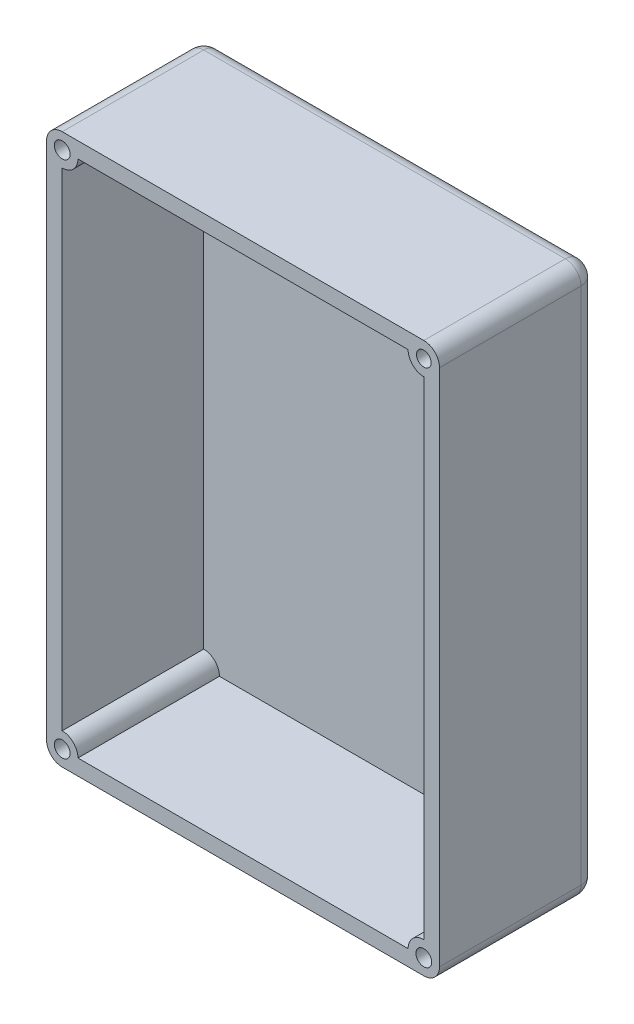
ISO-10303-21;
HEADER;
FILE_DESCRIPTION(('STEP AP214'),'2;1');
FILE_NAME('part.step','',(''),(''),'','','');
FILE_SCHEMA(('AUTOMOTIVE_DESIGN { 1 0 10303 214 1 1 1 1 }'));
ENDSEC;
DATA;
#1=APPLICATION_CONTEXT('core data for automotive mechanical design processes');
#2=APPLICATION_PROTOCOL_DEFINITION('international standard','automotive_design',2000,#1);
#3=PRODUCT_CONTEXT('',#1,'mechanical');
#4=PRODUCT('Part','Part','',(#3));
#5=PRODUCT_RELATED_PRODUCT_CATEGORY('part','',(#4));
#6=PRODUCT_DEFINITION_FORMATION('','',#4);
#7=PRODUCT_DEFINITION_CONTEXT('part definition',#1,'design');
#8=PRODUCT_DEFINITION('design','',#6,#7);
#9=PRODUCT_DEFINITION_SHAPE('','',#8);
#10=(LENGTH_UNIT() NAMED_UNIT(*) SI_UNIT(.MILLI.,.METRE.));
#11=(NAMED_UNIT(*) PLANE_ANGLE_UNIT() SI_UNIT($,.RADIAN.));
#12=(NAMED_UNIT(*) SI_UNIT($,.STERADIAN.) SOLID_ANGLE_UNIT());
#13=UNCERTAINTY_MEASURE_WITH_UNIT(LENGTH_MEASURE(1.E-05),#10,'distance_accuracy_value','');
#14=(GEOMETRIC_REPRESENTATION_CONTEXT(3) GLOBAL_UNCERTAINTY_ASSIGNED_CONTEXT((#13)) GLOBAL_UNIT_ASSIGNED_CONTEXT((#10,
#11,#12)) REPRESENTATION_CONTEXT('',''));
#15=CARTESIAN_POINT('',(0.,0.,0.));
#16=DIRECTION('',(0.,0.,1.));
#17=DIRECTION('',(1.,0.,0.));
#18=AXIS2_PLACEMENT_3D('',#15,#16,#17);
#19=CARTESIAN_POINT('',(0.,0.,-90.));
#20=DIRECTION('',(0.,0.,1.));
#21=DIRECTION('',(1.,0.,0.));
#22=AXIS2_PLACEMENT_3D('',#19,#20,#21);
#23=PLANE('',#22);
#24=DIRECTION('',(-1.,0.,0.));
#25=VECTOR('',#24,1.);
#26=CARTESIAN_POINT('',(10.,-10.,-90.));
#27=LINE('',#26,#25);
#28=CARTESIAN_POINT('',(230.,-10.,-90.));
#29=VERTEX_POINT('',#28);
#30=CARTESIAN_POINT('',(20.,-10.,-90.));
#31=VERTEX_POINT('',#30);
#32=EDGE_CURVE('E182',#29,#31,#27,.T.);
#33=ORIENTED_EDGE('',*,*,#32,.T.);
#34=CARTESIAN_POINT('',(10.,-10.,-90.));
#35=DIRECTION('',(0.,0.,1.));
#36=DIRECTION('',(1.,0.,0.));
#37=AXIS2_PLACEMENT_3D('',#34,#35,#36);
#38=CIRCLE('',#37,10.);
#39=CARTESIAN_POINT('',(10.,-20.,-90.));
#40=VERTEX_POINT('',#39);
#41=EDGE_CURVE('E11',#31,#40,#38,.F.);
#42=ORIENTED_EDGE('',*,*,#41,.T.);
#43=DIRECTION('',(0.,-1.,0.));
#44=VECTOR('',#43,1.);
#45=CARTESIAN_POINT('',(10.,-10.,-90.));
#46=LINE('',#45,#44);
#47=CARTESIAN_POINT('',(10.,-330.,-90.));
#48=VERTEX_POINT('',#47);
#49=EDGE_CURVE('E175',#40,#48,#46,.T.);
#50=ORIENTED_EDGE('',*,*,#49,.T.);
#51=CARTESIAN_POINT('',(10.,-340.,-90.));
#52=DIRECTION('',(0.,0.,1.));
#53=DIRECTION('',(1.,0.,0.));
#54=AXIS2_PLACEMENT_3D('',#51,#52,#53);
#55=CIRCLE('',#54,10.);
#56=CARTESIAN_POINT('',(20.,-340.,-90.));
#57=VERTEX_POINT('',#56);
#58=EDGE_CURVE('E48',#48,#57,#55,.F.);
#59=ORIENTED_EDGE('',*,*,#58,.T.);
#60=DIRECTION('',(1.,0.,0.));
#61=VECTOR('',#60,1.);
#62=CARTESIAN_POINT('',(10.,-340.,-90.));
#63=LINE('',#62,#61);
#64=CARTESIAN_POINT('',(230.,-340.,-90.));
#65=VERTEX_POINT('',#64);
#66=EDGE_CURVE('E217',#57,#65,#63,.T.);
#67=ORIENTED_EDGE('',*,*,#66,.T.);
#68=CARTESIAN_POINT('',(239.999998941204,-340.004601730969,-90.));
#69=DIRECTION('',(0.,0.,1.));
#70=DIRECTION('',(1.,0.,0.));
#71=AXIS2_PLACEMENT_3D('',#68,#69,#70);
#72=CIRCLE('',#71,10.);
#73=CARTESIAN_POINT('',(240.,-330.004601730969,-90.));
#74=VERTEX_POINT('',#73);
#75=EDGE_CURVE('E212',#65,#74,#72,.F.);
#76=ORIENTED_EDGE('',*,*,#75,.T.);
#77=DIRECTION('',(0.,1.,0.));
#78=VECTOR('',#77,1.);
#79=CARTESIAN_POINT('',(240.,-10.,-90.));
#80=LINE('',#79,#78);
#81=CARTESIAN_POINT('',(240.,-20.,-90.));
#82=VERTEX_POINT('',#81);
#83=EDGE_CURVE('E230',#74,#82,#80,.T.);
#84=ORIENTED_EDGE('',*,*,#83,.T.);
#85=CARTESIAN_POINT('',(240.,-10.,-90.));
#86=DIRECTION('',(0.,0.,1.));
#87=DIRECTION('',(1.,0.,0.));
#88=AXIS2_PLACEMENT_3D('',#85,#86,#87);
#89=CIRCLE('',#88,10.);
#90=EDGE_CURVE('E192',#82,#29,#89,.F.);
#91=ORIENTED_EDGE('',*,*,#90,.T.);
#92=EDGE_LOOP('',(#33,#42,#50,#59,#67,#76,#84,#91));
#93=FACE_BOUND('',#92,.T.);
#94=ADVANCED_FACE('F39',(#93),#23,.T.);
#95=CARTESIAN_POINT('',(10.,-10.,-90.));
#96=DIRECTION('',(0.,1.,0.));
#97=DIRECTION('',(-1.,0.,0.));
#98=AXIS2_PLACEMENT_3D('',#95,#96,#97);
#99=PLANE('',#98);
#100=DIRECTION('',(0.,0.,-1.));
#101=VECTOR('',#100,1.);
#102=CARTESIAN_POINT('',(20.,-10.,0.));
#103=LINE('',#102,#101);
#104=CARTESIAN_POINT('',(20.,-10.,0.));
#105=VERTEX_POINT('',#104);
#106=EDGE_CURVE('E788',#105,#31,#103,.T.);
#107=ORIENTED_EDGE('',*,*,#106,.T.);
#108=ORIENTED_EDGE('',*,*,#32,.F.);
#109=DIRECTION('',(0.,0.,-1.));
#110=VECTOR('',#109,1.);
#111=CARTESIAN_POINT('',(230.,-10.,0.));
#112=LINE('',#111,#110);
#113=CARTESIAN_POINT('',(230.,-10.,0.));
#114=VERTEX_POINT('',#113);
#115=EDGE_CURVE('E180',#114,#29,#112,.T.);
#116=ORIENTED_EDGE('',*,*,#115,.F.);
#117=DIRECTION('',(-1.,0.,0.));
#118=VECTOR('',#117,1.);
#119=CARTESIAN_POINT('',(10.,-10.,0.));
#120=LINE('',#119,#118);
#121=EDGE_CURVE('E163',#114,#105,#120,.T.);
#122=ORIENTED_EDGE('',*,*,#121,.T.);
#123=EDGE_LOOP('',(#107,#108,#116,#122));
#124=FACE_BOUND('',#123,.T.);
#125=ADVANCED_FACE('F181',(#124),#99,.F.);
#126=CARTESIAN_POINT('',(10.,-10.,-90.));
#127=DIRECTION('',(-1.,0.,0.));
#128=DIRECTION('',(0.,-1.,0.));
#129=AXIS2_PLACEMENT_3D('',#126,#127,#128);
#130=PLANE('',#129);
#131=DIRECTION('',(0.,0.,-1.));
#132=VECTOR('',#131,1.);
#133=CARTESIAN_POINT('',(10.,-20.,0.));
#134=LINE('',#133,#132);
#135=CARTESIAN_POINT('',(10.,-20.,0.));
#136=VERTEX_POINT('',#135);
#137=EDGE_CURVE('E794',#136,#40,#134,.T.);
#138=ORIENTED_EDGE('',*,*,#137,.F.);
#139=DIRECTION('',(0.,-1.,0.));
#140=VECTOR('',#139,1.);
#141=CARTESIAN_POINT('',(10.,-10.,0.));
#142=LINE('',#141,#140);
#143=CARTESIAN_POINT('',(10.,-330.,0.));
#144=VERTEX_POINT('',#143);
#145=EDGE_CURVE('E255',#136,#144,#142,.T.);
#146=ORIENTED_EDGE('',*,*,#145,.T.);
#147=DIRECTION('',(0.,0.,-1.));
#148=VECTOR('',#147,1.);
#149=CARTESIAN_POINT('',(10.,-330.,0.));
#150=LINE('',#149,#148);
#151=EDGE_CURVE('E236',#144,#48,#150,.T.);
#152=ORIENTED_EDGE('',*,*,#151,.T.);
#153=ORIENTED_EDGE('',*,*,#49,.F.);
#154=EDGE_LOOP('',(#138,#146,#152,#153));
#155=FACE_BOUND('',#154,.T.);
#156=ADVANCED_FACE('F457',(#155),#130,.F.);
#157=CARTESIAN_POINT('',(240.,-10.,-90.));
#158=DIRECTION('',(1.,0.,0.));
#159=DIRECTION('',(0.,1.,0.));
#160=AXIS2_PLACEMENT_3D('',#157,#158,#159);
#161=PLANE('',#160);
#162=DIRECTION('',(0.,0.,-1.));
#163=VECTOR('',#162,1.);
#164=CARTESIAN_POINT('',(240.,-20.,0.));
#165=LINE('',#164,#163);
#166=CARTESIAN_POINT('',(240.,-20.,0.));
#167=VERTEX_POINT('',#166);
#168=EDGE_CURVE('E186',#167,#82,#165,.T.);
#169=ORIENTED_EDGE('',*,*,#168,.T.);
#170=ORIENTED_EDGE('',*,*,#83,.F.);
#171=DIRECTION('',(0.,0.,-1.));
#172=VECTOR('',#171,1.);
#173=CARTESIAN_POINT('',(240.,-330.004601730969,0.));
#174=LINE('',#173,#172);
#175=CARTESIAN_POINT('',(240.,-330.004601730969,0.));
#176=VERTEX_POINT('',#175);
#177=EDGE_CURVE('E243',#176,#74,#174,.T.);
#178=ORIENTED_EDGE('',*,*,#177,.F.);
#179=DIRECTION('',(0.,1.,0.));
#180=VECTOR('',#179,1.);
#181=CARTESIAN_POINT('',(240.,-10.,0.));
#182=LINE('',#181,#180);
#183=EDGE_CURVE('E176',#176,#167,#182,.T.);
#184=ORIENTED_EDGE('',*,*,#183,.T.);
#185=EDGE_LOOP('',(#169,#170,#178,#184));
#186=FACE_BOUND('',#185,.T.);
#187=ADVANCED_FACE('F463',(#186),#161,.F.);
#188=CARTESIAN_POINT('',(10.,-340.,-90.));
#189=DIRECTION('',(0.,-1.,0.));
#190=DIRECTION('',(0.,0.,-1.));
#191=AXIS2_PLACEMENT_3D('',#188,#189,#190);
#192=PLANE('',#191);
#193=DIRECTION('',(0.,0.,-1.));
#194=VECTOR('',#193,1.);
#195=CARTESIAN_POINT('',(230.,-340.,0.));
#196=LINE('',#195,#194);
#197=CARTESIAN_POINT('',(230.,-340.,0.));
#198=VERTEX_POINT('',#197);
#199=EDGE_CURVE('E185',#198,#65,#196,.T.);
#200=ORIENTED_EDGE('',*,*,#199,.T.);
#201=ORIENTED_EDGE('',*,*,#66,.F.);
#202=DIRECTION('',(0.,0.,-1.));
#203=VECTOR('',#202,1.);
#204=CARTESIAN_POINT('',(20.,-340.,0.));
#205=LINE('',#204,#203);
#206=CARTESIAN_POINT('',(20.,-340.,0.));
#207=VERTEX_POINT('',#206);
#208=EDGE_CURVE('E226',#207,#57,#205,.T.);
#209=ORIENTED_EDGE('',*,*,#208,.F.);
#210=DIRECTION('',(1.,0.,0.));
#211=VECTOR('',#210,1.);
#212=CARTESIAN_POINT('',(10.,-340.,0.));
#213=LINE('',#212,#211);
#214=EDGE_CURVE('E259',#207,#198,#213,.T.);
#215=ORIENTED_EDGE('',*,*,#214,.T.);
#216=EDGE_LOOP('',(#200,#201,#209,#215));
#217=FACE_BOUND('',#216,.T.);
#218=ADVANCED_FACE('F224',(#217),#192,.F.);
#219=CARTESIAN_POINT('',(0.,0.,-100.));
#220=DIRECTION('',(-1.,0.,0.));
#221=DIRECTION('',(0.,0.,1.));
#222=AXIS2_PLACEMENT_3D('',#219,#220,#221);
#223=PLANE('',#222);
#224=DIRECTION('',(0.,-1.,0.));
#225=VECTOR('',#224,1.);
#226=CARTESIAN_POINT('',(0.,-350.,-90.0000000000001));
#227=LINE('',#226,#225);
#228=CARTESIAN_POINT('',(0.,-10.,-90.0000000000001));
#229=VERTEX_POINT('',#228);
#230=CARTESIAN_POINT('',(0.,-340.,-90.0000000000001));
#231=VERTEX_POINT('',#230);
#232=EDGE_CURVE('E282',#229,#231,#227,.T.);
#233=ORIENTED_EDGE('',*,*,#232,.T.);
#234=DIRECTION('',(0.,0.,1.));
#235=VECTOR('',#234,1.);
#236=CARTESIAN_POINT('',(0.,-340.,-100.));
#237=LINE('',#236,#235);
#238=CARTESIAN_POINT('',(0.,-340.,0.));
#239=VERTEX_POINT('',#238);
#240=EDGE_CURVE('E285',#231,#239,#237,.T.);
#241=ORIENTED_EDGE('',*,*,#240,.T.);
#242=DIRECTION('',(0.,-1.,0.));
#243=VECTOR('',#242,1.);
#244=CARTESIAN_POINT('',(0.,0.,0.));
#245=LINE('',#244,#243);
#246=CARTESIAN_POINT('',(0.,-10.,0.));
#247=VERTEX_POINT('',#246);
#248=EDGE_CURVE('E254',#247,#239,#245,.T.);
#249=ORIENTED_EDGE('',*,*,#248,.F.);
#250=DIRECTION('',(0.,0.,1.));
#251=VECTOR('',#250,1.);
#252=CARTESIAN_POINT('',(0.,-10.,-100.));
#253=LINE('',#252,#251);
#254=EDGE_CURVE('E279',#247,#229,#253,.F.);
#255=ORIENTED_EDGE('',*,*,#254,.T.);
#256=EDGE_LOOP('',(#233,#241,#249,#255));
#257=FACE_BOUND('',#256,.T.);
#258=ADVANCED_FACE('F428',(#257),#223,.T.);
#259=CARTESIAN_POINT('',(0.,0.,-100.));
#260=DIRECTION('',(0.,1.,0.));
#261=DIRECTION('',(0.,0.,1.));
#262=AXIS2_PLACEMENT_3D('',#259,#260,#261);
#263=PLANE('',#262);
#264=DIRECTION('',(-1.,0.,0.));
#265=VECTOR('',#264,1.);
#266=CARTESIAN_POINT('',(0.,0.,0.));
#267=LINE('',#266,#265);
#268=CARTESIAN_POINT('',(240.,0.,0.));
#269=VERTEX_POINT('',#268);
#270=CARTESIAN_POINT('',(10.,0.,0.));
#271=VERTEX_POINT('',#270);
#272=EDGE_CURVE('E275',#269,#271,#267,.T.);
#273=ORIENTED_EDGE('',*,*,#272,.F.);
#274=DIRECTION('',(0.,0.,1.));
#275=VECTOR('',#274,1.);
#276=CARTESIAN_POINT('',(240.,0.,-100.));
#277=LINE('',#276,#275);
#278=CARTESIAN_POINT('',(240.,0.,-90.0000000000001));
#279=VERTEX_POINT('',#278);
#280=EDGE_CURVE('E193',#269,#279,#277,.F.);
#281=ORIENTED_EDGE('',*,*,#280,.T.);
#282=DIRECTION('',(-1.,0.,0.));
#283=VECTOR('',#282,1.);
#284=CARTESIAN_POINT('',(0.,0.,-90.0000000000001));
#285=LINE('',#284,#283);
#286=CARTESIAN_POINT('',(10.,0.,-90.0000000000001));
#287=VERTEX_POINT('',#286);
#288=EDGE_CURVE('E198',#279,#287,#285,.T.);
#289=ORIENTED_EDGE('',*,*,#288,.T.);
#290=DIRECTION('',(0.,0.,1.));
#291=VECTOR('',#290,1.);
#292=CARTESIAN_POINT('',(10.,0.,-100.));
#293=LINE('',#292,#291);
#294=EDGE_CURVE('E332',#287,#271,#293,.T.);
#295=ORIENTED_EDGE('',*,*,#294,.T.);
#296=EDGE_LOOP('',(#273,#281,#289,#295));
#297=FACE_BOUND('',#296,.T.);
#298=ADVANCED_FACE('F419',(#297),#263,.T.);
#299=CARTESIAN_POINT('',(250.,0.,-100.));
#300=DIRECTION('',(1.,0.,0.));
#301=DIRECTION('',(0.,1.,0.));
#302=AXIS2_PLACEMENT_3D('',#299,#300,#301);
#303=PLANE('',#302);
#304=DIRECTION('',(0.,1.,0.));
#305=VECTOR('',#304,1.);
#306=CARTESIAN_POINT('',(250.,0.,0.));
#307=LINE('',#306,#305);
#308=CARTESIAN_POINT('',(250.,-340.,0.));
#309=VERTEX_POINT('',#308);
#310=CARTESIAN_POINT('',(250.,-9.99999999999999,0.));
#311=VERTEX_POINT('',#310);
#312=EDGE_CURVE('E271',#309,#311,#307,.T.);
#313=ORIENTED_EDGE('',*,*,#312,.F.);
#314=DIRECTION('',(0.,0.,1.));
#315=VECTOR('',#314,1.);
#316=CARTESIAN_POINT('',(250.,-340.,-100.));
#317=LINE('',#316,#315);
#318=CARTESIAN_POINT('',(250.,-340.,-90.0000000000001));
#319=VERTEX_POINT('',#318);
#320=EDGE_CURVE('E316',#309,#319,#317,.F.);
#321=ORIENTED_EDGE('',*,*,#320,.T.);
#322=DIRECTION('',(0.,1.,0.));
#323=VECTOR('',#322,1.);
#324=CARTESIAN_POINT('',(250.,0.,-90.0000000000001));
#325=LINE('',#324,#323);
#326=CARTESIAN_POINT('',(250.,-9.99999999999999,-90.0000000000001));
#327=VERTEX_POINT('',#326);
#328=EDGE_CURVE('E313',#319,#327,#325,.T.);
#329=ORIENTED_EDGE('',*,*,#328,.T.);
#330=DIRECTION('',(0.,0.,1.));
#331=VECTOR('',#330,1.);
#332=CARTESIAN_POINT('',(250.,-9.99999999999999,-100.));
#333=LINE('',#332,#331);
#334=EDGE_CURVE('E310',#327,#311,#333,.T.);
#335=ORIENTED_EDGE('',*,*,#334,.T.);
#336=EDGE_LOOP('',(#313,#321,#329,#335));
#337=FACE_BOUND('',#336,.T.);
#338=ADVANCED_FACE('F391',(#337),#303,.T.);
#339=CARTESIAN_POINT('',(0.,-350.,-100.));
#340=DIRECTION('',(0.,-1.,0.));
#341=DIRECTION('',(0.,0.,-1.));
#342=AXIS2_PLACEMENT_3D('',#339,#340,#341);
#343=PLANE('',#342);
#344=DIRECTION('',(1.,0.,0.));
#345=VECTOR('',#344,1.);
#346=CARTESIAN_POINT('',(0.,-350.,0.));
#347=LINE('',#346,#345);
#348=CARTESIAN_POINT('',(10.,-350.,0.));
#349=VERTEX_POINT('',#348);
#350=CARTESIAN_POINT('',(240.,-350.,0.));
#351=VERTEX_POINT('',#350);
#352=EDGE_CURVE('E267',#349,#351,#347,.T.);
#353=ORIENTED_EDGE('',*,*,#352,.F.);
#354=DIRECTION('',(0.,0.,1.));
#355=VECTOR('',#354,1.);
#356=CARTESIAN_POINT('',(10.,-350.,-100.));
#357=LINE('',#356,#355);
#358=CARTESIAN_POINT('',(10.,-350.,-90.0000000000001));
#359=VERTEX_POINT('',#358);
#360=EDGE_CURVE('E307',#349,#359,#357,.F.);
#361=ORIENTED_EDGE('',*,*,#360,.T.);
#362=DIRECTION('',(1.,0.,0.));
#363=VECTOR('',#362,1.);
#364=CARTESIAN_POINT('',(250.,-350.,-90.0000000000001));
#365=LINE('',#364,#363);
#366=CARTESIAN_POINT('',(240.,-350.,-90.0000000000001));
#367=VERTEX_POINT('',#366);
#368=EDGE_CURVE('E301',#359,#367,#365,.T.);
#369=ORIENTED_EDGE('',*,*,#368,.T.);
#370=DIRECTION('',(0.,0.,1.));
#371=VECTOR('',#370,1.);
#372=CARTESIAN_POINT('',(240.,-350.,-100.));
#373=LINE('',#372,#371);
#374=EDGE_CURVE('E304',#367,#351,#373,.T.);
#375=ORIENTED_EDGE('',*,*,#374,.T.);
#376=EDGE_LOOP('',(#353,#361,#369,#375));
#377=FACE_BOUND('',#376,.T.);
#378=ADVANCED_FACE('F437',(#377),#343,.T.);
#379=CARTESIAN_POINT('',(0.,0.,-100.));
#380=DIRECTION('',(0.,0.,1.));
#381=DIRECTION('',(1.,0.,0.));
#382=AXIS2_PLACEMENT_3D('',#379,#380,#381);
#383=PLANE('',#382);
#384=DIRECTION('',(0.,1.,0.));
#385=VECTOR('',#384,1.);
#386=CARTESIAN_POINT('',(240.,-350.,-100.));
#387=LINE('',#386,#385);
#388=CARTESIAN_POINT('',(240.,-10.,-100.));
#389=VERTEX_POINT('',#388);
#390=CARTESIAN_POINT('',(240.,-340.,-100.));
#391=VERTEX_POINT('',#390);
#392=EDGE_CURVE('E322',#389,#391,#387,.F.);
#393=ORIENTED_EDGE('',*,*,#392,.T.);
#394=DIRECTION('',(1.,0.,0.));
#395=VECTOR('',#394,1.);
#396=CARTESIAN_POINT('',(0.,-340.,-100.));
#397=LINE('',#396,#395);
#398=CARTESIAN_POINT('',(10.,-340.,-100.));
#399=VERTEX_POINT('',#398);
#400=EDGE_CURVE('E328',#391,#399,#397,.F.);
#401=ORIENTED_EDGE('',*,*,#400,.T.);
#402=DIRECTION('',(0.,-1.,0.));
#403=VECTOR('',#402,1.);
#404=CARTESIAN_POINT('',(10.,0.,-100.));
#405=LINE('',#404,#403);
#406=CARTESIAN_POINT('',(10.,-10.,-100.));
#407=VERTEX_POINT('',#406);
#408=EDGE_CURVE('E325',#399,#407,#405,.F.);
#409=ORIENTED_EDGE('',*,*,#408,.T.);
#410=DIRECTION('',(-1.,0.,0.));
#411=VECTOR('',#410,1.);
#412=CARTESIAN_POINT('',(250.,-10.,-100.));
#413=LINE('',#412,#411);
#414=EDGE_CURVE('E319',#407,#389,#413,.F.);
#415=ORIENTED_EDGE('',*,*,#414,.T.);
#416=EDGE_LOOP('',(#393,#401,#409,#415));
#417=FACE_BOUND('',#416,.T.);
#418=ADVANCED_FACE('F412',(#417),#383,.F.);
#419=CARTESIAN_POINT('',(0.,0.,0.));
#420=DIRECTION('',(0.,0.,1.));
#421=DIRECTION('',(1.,0.,0.));
#422=AXIS2_PLACEMENT_3D('',#419,#420,#421);
#423=PLANE('',#422);
#424=CARTESIAN_POINT('',(10.,-340.,0.));
#425=DIRECTION('',(0.,0.,1.));
#426=DIRECTION('',(1.,0.,0.));
#427=AXIS2_PLACEMENT_3D('',#424,#425,#426);
#428=CIRCLE('',#427,5.);
#429=CARTESIAN_POINT('',(15.,-340.,0.));
#430=VERTEX_POINT('',#429);
#431=EDGE_CURVE('E762',#430,#430,#428,.T.);
#432=ORIENTED_EDGE('',*,*,#431,.F.);
#433=EDGE_LOOP('',(#432));
#434=FACE_BOUND('',#433,.T.);
#435=CARTESIAN_POINT('',(239.999998941204,-340.004601730969,0.));
#436=DIRECTION('',(0.,0.,1.));
#437=DIRECTION('',(1.,0.,0.));
#438=AXIS2_PLACEMENT_3D('',#435,#436,#437);
#439=CIRCLE('',#438,4.99999999999999);
#440=CARTESIAN_POINT('',(244.999998941204,-340.004601730969,0.));
#441=VERTEX_POINT('',#440);
#442=EDGE_CURVE('E761',#441,#441,#439,.T.);
#443=ORIENTED_EDGE('',*,*,#442,.F.);
#444=EDGE_LOOP('',(#443));
#445=FACE_BOUND('',#444,.T.);
#446=CARTESIAN_POINT('',(10.,-10.,0.));
#447=DIRECTION('',(0.,0.,1.));
#448=DIRECTION('',(1.,0.,0.));
#449=AXIS2_PLACEMENT_3D('',#446,#447,#448);
#450=CIRCLE('',#449,5.);
#451=CARTESIAN_POINT('',(15.,-10.,0.));
#452=VERTEX_POINT('',#451);
#453=EDGE_CURVE('E774',#452,#452,#450,.T.);
#454=ORIENTED_EDGE('',*,*,#453,.F.);
#455=EDGE_LOOP('',(#454));
#456=FACE_BOUND('',#455,.T.);
#457=CARTESIAN_POINT('',(240.,-10.,0.));
#458=DIRECTION('',(0.,0.,1.));
#459=DIRECTION('',(1.,0.,0.));
#460=AXIS2_PLACEMENT_3D('',#457,#458,#459);
#461=CIRCLE('',#460,4.66802014218502);
#462=CARTESIAN_POINT('',(244.668020142185,-10.,0.));
#463=VERTEX_POINT('',#462);
#464=EDGE_CURVE('E780',#463,#463,#461,.T.);
#465=ORIENTED_EDGE('',*,*,#464,.F.);
#466=EDGE_LOOP('',(#465));
#467=FACE_BOUND('',#466,.T.);
#468=ORIENTED_EDGE('',*,*,#183,.F.);
#469=CARTESIAN_POINT('',(239.999998941204,-340.004601730969,0.));
#470=DIRECTION('',(0.,0.,1.));
#471=DIRECTION('',(1.,0.,0.));
#472=AXIS2_PLACEMENT_3D('',#469,#470,#471);
#473=CIRCLE('',#472,10.);
#474=EDGE_CURVE('E209',#176,#198,#473,.T.);
#475=ORIENTED_EDGE('',*,*,#474,.T.);
#476=ORIENTED_EDGE('',*,*,#214,.F.);
#477=CARTESIAN_POINT('',(10.,-340.,0.));
#478=DIRECTION('',(0.,0.,1.));
#479=DIRECTION('',(1.,0.,0.));
#480=AXIS2_PLACEMENT_3D('',#477,#478,#479);
#481=CIRCLE('',#480,10.);
#482=EDGE_CURVE('E206',#207,#144,#481,.T.);
#483=ORIENTED_EDGE('',*,*,#482,.T.);
#484=ORIENTED_EDGE('',*,*,#145,.F.);
#485=CARTESIAN_POINT('',(10.,-10.,0.));
#486=DIRECTION('',(0.,0.,1.));
#487=DIRECTION('',(1.,0.,0.));
#488=AXIS2_PLACEMENT_3D('',#485,#486,#487);
#489=CIRCLE('',#488,10.);
#490=EDGE_CURVE('E172',#136,#105,#489,.T.);
#491=ORIENTED_EDGE('',*,*,#490,.T.);
#492=ORIENTED_EDGE('',*,*,#121,.F.);
#493=CARTESIAN_POINT('',(240.,-10.,0.));
#494=DIRECTION('',(0.,0.,1.));
#495=DIRECTION('',(1.,0.,0.));
#496=AXIS2_PLACEMENT_3D('',#493,#494,#495);
#497=CIRCLE('',#496,10.);
#498=EDGE_CURVE('E168',#114,#167,#497,.T.);
#499=ORIENTED_EDGE('',*,*,#498,.T.);
#500=EDGE_LOOP('',(#468,#475,#476,#483,#484,#491,#492,#499));
#501=FACE_BOUND('',#500,.T.);
#502=ORIENTED_EDGE('',*,*,#248,.T.);
#503=CARTESIAN_POINT('',(10.,-340.,0.));
#504=DIRECTION('',(0.,0.,1.));
#505=DIRECTION('',(1.,0.,0.));
#506=AXIS2_PLACEMENT_3D('',#503,#504,#505);
#507=CIRCLE('',#506,10.);
#508=EDGE_CURVE('E298',#239,#349,#507,.T.);
#509=ORIENTED_EDGE('',*,*,#508,.T.);
#510=ORIENTED_EDGE('',*,*,#352,.T.);
#511=CARTESIAN_POINT('',(240.,-340.,0.));
#512=DIRECTION('',(0.,0.,1.));
#513=DIRECTION('',(1.,0.,0.));
#514=AXIS2_PLACEMENT_3D('',#511,#512,#513);
#515=CIRCLE('',#514,10.);
#516=EDGE_CURVE('E295',#351,#309,#515,.T.);
#517=ORIENTED_EDGE('',*,*,#516,.T.);
#518=ORIENTED_EDGE('',*,*,#312,.T.);
#519=CARTESIAN_POINT('',(240.,-10.,0.));
#520=DIRECTION('',(0.,0.,1.));
#521=DIRECTION('',(1.,0.,0.));
#522=AXIS2_PLACEMENT_3D('',#519,#520,#521);
#523=CIRCLE('',#522,10.);
#524=EDGE_CURVE('E292',#311,#269,#523,.T.);
#525=ORIENTED_EDGE('',*,*,#524,.T.);
#526=ORIENTED_EDGE('',*,*,#272,.T.);
#527=CARTESIAN_POINT('',(10.,-10.,0.));
#528=DIRECTION('',(0.,0.,1.));
#529=DIRECTION('',(1.,0.,0.));
#530=AXIS2_PLACEMENT_3D('',#527,#528,#529);
#531=CIRCLE('',#530,10.);
#532=EDGE_CURVE('E289',#271,#247,#531,.T.);
#533=ORIENTED_EDGE('',*,*,#532,.T.);
#534=EDGE_LOOP('',(#502,#509,#510,#517,#518,#525,#526,#533));
#535=FACE_BOUND('',#534,.T.);
#536=ADVANCED_FACE('F165',(#434,#445,#456,#467,#501,#535),#423,.T.);
#537=CARTESIAN_POINT('',(240.,-10.,-100.));
#538=DIRECTION('',(0.,0.,1.));
#539=DIRECTION('',(1.,0.,0.));
#540=AXIS2_PLACEMENT_3D('',#537,#538,#539);
#541=CYLINDRICAL_SURFACE('',#540,10.);
#542=CARTESIAN_POINT('',(240.,-10.,-90.0000000000001));
#543=DIRECTION('',(0.,0.,-1.));
#544=DIRECTION('',(-1.,0.,0.));
#545=AXIS2_PLACEMENT_3D('',#542,#543,#544);
#546=CIRCLE('',#545,10.);
#547=EDGE_CURVE('E201',#279,#327,#546,.T.);
#548=ORIENTED_EDGE('',*,*,#547,.F.);
#549=ORIENTED_EDGE('',*,*,#280,.F.);
#550=ORIENTED_EDGE('',*,*,#524,.F.);
#551=ORIENTED_EDGE('',*,*,#334,.F.);
#552=EDGE_LOOP('',(#548,#549,#550,#551));
#553=FACE_BOUND('',#552,.T.);
#554=ADVANCED_FACE('F387',(#553),#541,.T.);
#555=CARTESIAN_POINT('',(240.,-10.,-90.0000000000001));
#556=DIRECTION('',(0.,0.,1.));
#557=DIRECTION('',(1.,0.,0.));
#558=AXIS2_PLACEMENT_3D('',#555,#556,#557);
#559=SPHERICAL_SURFACE('',#558,10.);
#560=CARTESIAN_POINT('',(240.,-10.,-90.0000000000001));
#561=DIRECTION('',(1.,0.,0.));
#562=DIRECTION('',(0.,0.,-1.));
#563=AXIS2_PLACEMENT_3D('',#560,#561,#562);
#564=CIRCLE('',#563,10.);
#565=EDGE_CURVE('E367',#279,#389,#564,.F.);
#566=ORIENTED_EDGE('',*,*,#565,.F.);
#567=ORIENTED_EDGE('',*,*,#547,.T.);
#568=CARTESIAN_POINT('',(240.,-10.,-90.0000000000001));
#569=DIRECTION('',(0.,1.,0.));
#570=DIRECTION('',(-1.,0.,0.));
#571=AXIS2_PLACEMENT_3D('',#568,#569,#570);
#572=CIRCLE('',#571,10.);
#573=EDGE_CURVE('E370',#389,#327,#572,.F.);
#574=ORIENTED_EDGE('',*,*,#573,.F.);
#575=EDGE_LOOP('',(#566,#567,#574));
#576=FACE_BOUND('',#575,.T.);
#577=ADVANCED_FACE('F382',(#576),#559,.T.);
#578=CARTESIAN_POINT('',(240.,-340.,-100.));
#579=DIRECTION('',(0.,0.,1.));
#580=DIRECTION('',(1.,0.,0.));
#581=AXIS2_PLACEMENT_3D('',#578,#579,#580);
#582=CYLINDRICAL_SURFACE('',#581,10.);
#583=ORIENTED_EDGE('',*,*,#516,.F.);
#584=ORIENTED_EDGE('',*,*,#374,.F.);
#585=CARTESIAN_POINT('',(240.,-340.,-90.0000000000001));
#586=DIRECTION('',(0.,0.,-1.));
#587=DIRECTION('',(-1.,0.,0.));
#588=AXIS2_PLACEMENT_3D('',#585,#586,#587);
#589=CIRCLE('',#588,10.);
#590=EDGE_CURVE('E363',#319,#367,#589,.T.);
#591=ORIENTED_EDGE('',*,*,#590,.F.);
#592=ORIENTED_EDGE('',*,*,#320,.F.);
#593=EDGE_LOOP('',(#583,#584,#591,#592));
#594=FACE_BOUND('',#593,.T.);
#595=ADVANCED_FACE('F398',(#594),#582,.T.);
#596=CARTESIAN_POINT('',(240.,0.,-90.0000000000001));
#597=DIRECTION('',(0.,-1.,0.));
#598=DIRECTION('',(1.,0.,0.));
#599=AXIS2_PLACEMENT_3D('',#596,#597,#598);
#600=CYLINDRICAL_SURFACE('',#599,10.);
#601=ORIENTED_EDGE('',*,*,#573,.T.);
#602=ORIENTED_EDGE('',*,*,#328,.F.);
#603=CARTESIAN_POINT('',(240.,-340.,-90.0000000000001));
#604=DIRECTION('',(0.,-1.,0.));
#605=DIRECTION('',(0.,0.,-1.));
#606=AXIS2_PLACEMENT_3D('',#603,#604,#605);
#607=CIRCLE('',#606,10.);
#608=EDGE_CURVE('E359',#391,#319,#607,.T.);
#609=ORIENTED_EDGE('',*,*,#608,.F.);
#610=ORIENTED_EDGE('',*,*,#392,.F.);
#611=EDGE_LOOP('',(#601,#602,#609,#610));
#612=FACE_BOUND('',#611,.T.);
#613=ADVANCED_FACE('F401',(#612),#600,.T.);
#614=CARTESIAN_POINT('',(0.,-10.,-90.0000000000001));
#615=DIRECTION('',(1.,0.,0.));
#616=DIRECTION('',(0.,0.,-1.));
#617=AXIS2_PLACEMENT_3D('',#614,#615,#616);
#618=CYLINDRICAL_SURFACE('',#617,10.);
#619=ORIENTED_EDGE('',*,*,#565,.T.);
#620=ORIENTED_EDGE('',*,*,#414,.F.);
#621=CARTESIAN_POINT('',(10.,-10.,-90.0000000000001));
#622=DIRECTION('',(-1.,0.,0.));
#623=DIRECTION('',(0.,0.,1.));
#624=AXIS2_PLACEMENT_3D('',#621,#622,#623);
#625=CIRCLE('',#624,10.);
#626=EDGE_CURVE('E355',#287,#407,#625,.T.);
#627=ORIENTED_EDGE('',*,*,#626,.F.);
#628=ORIENTED_EDGE('',*,*,#288,.F.);
#629=EDGE_LOOP('',(#619,#620,#627,#628));
#630=FACE_BOUND('',#629,.T.);
#631=ADVANCED_FACE('F416',(#630),#618,.T.);
#632=CARTESIAN_POINT('',(10.,-10.,-100.));
#633=DIRECTION('',(0.,0.,1.));
#634=DIRECTION('',(1.,0.,0.));
#635=AXIS2_PLACEMENT_3D('',#632,#633,#634);
#636=CYLINDRICAL_SURFACE('',#635,10.);
#637=ORIENTED_EDGE('',*,*,#532,.F.);
#638=ORIENTED_EDGE('',*,*,#294,.F.);
#639=CARTESIAN_POINT('',(10.,-10.,-90.0000000000001));
#640=DIRECTION('',(0.,0.,-1.));
#641=DIRECTION('',(-1.,0.,0.));
#642=AXIS2_PLACEMENT_3D('',#639,#640,#641);
#643=CIRCLE('',#642,10.);
#644=EDGE_CURVE('E351',#229,#287,#643,.T.);
#645=ORIENTED_EDGE('',*,*,#644,.F.);
#646=ORIENTED_EDGE('',*,*,#254,.F.);
#647=EDGE_LOOP('',(#637,#638,#645,#646));
#648=FACE_BOUND('',#647,.T.);
#649=ADVANCED_FACE('F423',(#648),#636,.T.);
#650=CARTESIAN_POINT('',(240.,-340.,-90.0000000000001));
#651=DIRECTION('',(0.,0.,1.));
#652=DIRECTION('',(1.,0.,0.));
#653=AXIS2_PLACEMENT_3D('',#650,#651,#652);
#654=SPHERICAL_SURFACE('',#653,10.);
#655=ORIENTED_EDGE('',*,*,#608,.T.);
#656=ORIENTED_EDGE('',*,*,#590,.T.);
#657=CARTESIAN_POINT('',(240.,-340.,-90.0000000000001));
#658=DIRECTION('',(1.,0.,0.));
#659=DIRECTION('',(0.,0.,-1.));
#660=AXIS2_PLACEMENT_3D('',#657,#658,#659);
#661=CIRCLE('',#660,10.);
#662=EDGE_CURVE('E347',#391,#367,#661,.F.);
#663=ORIENTED_EDGE('',*,*,#662,.F.);
#664=EDGE_LOOP('',(#655,#656,#663));
#665=FACE_BOUND('',#664,.T.);
#666=ADVANCED_FACE('F405',(#665),#654,.T.);
#667=CARTESIAN_POINT('',(10.,-10.,-90.0000000000001));
#668=DIRECTION('',(0.,0.,1.));
#669=DIRECTION('',(1.,0.,0.));
#670=AXIS2_PLACEMENT_3D('',#667,#668,#669);
#671=SPHERICAL_SURFACE('',#670,10.);
#672=ORIENTED_EDGE('',*,*,#644,.T.);
#673=ORIENTED_EDGE('',*,*,#626,.T.);
#674=CARTESIAN_POINT('',(10.,-10.,-90.0000000000001));
#675=DIRECTION('',(0.,1.,0.));
#676=DIRECTION('',(0.,0.,1.));
#677=AXIS2_PLACEMENT_3D('',#674,#675,#676);
#678=CIRCLE('',#677,10.);
#679=EDGE_CURVE('E343',#229,#407,#678,.F.);
#680=ORIENTED_EDGE('',*,*,#679,.F.);
#681=EDGE_LOOP('',(#672,#673,#680));
#682=FACE_BOUND('',#681,.T.);
#683=ADVANCED_FACE('F443',(#682),#671,.T.);
#684=CARTESIAN_POINT('',(0.,-340.,-90.0000000000001));
#685=DIRECTION('',(-1.,0.,0.));
#686=DIRECTION('',(0.,0.,1.));
#687=AXIS2_PLACEMENT_3D('',#684,#685,#686);
#688=CYLINDRICAL_SURFACE('',#687,10.);
#689=ORIENTED_EDGE('',*,*,#662,.T.);
#690=ORIENTED_EDGE('',*,*,#368,.F.);
#691=CARTESIAN_POINT('',(10.,-340.,-90.0000000000001));
#692=DIRECTION('',(-1.,0.,0.));
#693=DIRECTION('',(0.,0.,1.));
#694=AXIS2_PLACEMENT_3D('',#691,#692,#693);
#695=CIRCLE('',#694,10.);
#696=EDGE_CURVE('E339',#399,#359,#695,.T.);
#697=ORIENTED_EDGE('',*,*,#696,.F.);
#698=ORIENTED_EDGE('',*,*,#400,.F.);
#699=EDGE_LOOP('',(#689,#690,#697,#698));
#700=FACE_BOUND('',#699,.T.);
#701=ADVANCED_FACE('F409',(#700),#688,.T.);
#702=CARTESIAN_POINT('',(10.,0.,-90.0000000000001));
#703=DIRECTION('',(0.,1.,0.));
#704=DIRECTION('',(0.,0.,1.));
#705=AXIS2_PLACEMENT_3D('',#702,#703,#704);
#706=CYLINDRICAL_SURFACE('',#705,10.);
#707=ORIENTED_EDGE('',*,*,#679,.T.);
#708=ORIENTED_EDGE('',*,*,#408,.F.);
#709=CARTESIAN_POINT('',(10.,-340.,-90.0000000000001));
#710=DIRECTION('',(0.,-1.,0.));
#711=DIRECTION('',(0.,0.,-1.));
#712=AXIS2_PLACEMENT_3D('',#709,#710,#711);
#713=CIRCLE('',#712,10.);
#714=EDGE_CURVE('E241',#231,#399,#713,.T.);
#715=ORIENTED_EDGE('',*,*,#714,.F.);
#716=ORIENTED_EDGE('',*,*,#232,.F.);
#717=EDGE_LOOP('',(#707,#708,#715,#716));
#718=FACE_BOUND('',#717,.T.);
#719=ADVANCED_FACE('F441',(#718),#706,.T.);
#720=CARTESIAN_POINT('',(10.,-340.,-90.0000000000001));
#721=DIRECTION('',(0.,0.,1.));
#722=DIRECTION('',(1.,0.,0.));
#723=AXIS2_PLACEMENT_3D('',#720,#721,#722);
#724=SPHERICAL_SURFACE('',#723,10.);
#725=ORIENTED_EDGE('',*,*,#714,.T.);
#726=ORIENTED_EDGE('',*,*,#696,.T.);
#727=CARTESIAN_POINT('',(10.,-340.,-90.0000000000001));
#728=DIRECTION('',(0.,0.,-1.));
#729=DIRECTION('',(-1.,0.,0.));
#730=AXIS2_PLACEMENT_3D('',#727,#728,#729);
#731=CIRCLE('',#730,10.);
#732=EDGE_CURVE('E235',#231,#359,#731,.F.);
#733=ORIENTED_EDGE('',*,*,#732,.F.);
#734=EDGE_LOOP('',(#725,#726,#733));
#735=FACE_BOUND('',#734,.T.);
#736=ADVANCED_FACE('F439',(#735),#724,.T.);
#737=CARTESIAN_POINT('',(10.,-340.,-100.));
#738=DIRECTION('',(0.,0.,1.));
#739=DIRECTION('',(1.,0.,0.));
#740=AXIS2_PLACEMENT_3D('',#737,#738,#739);
#741=CYLINDRICAL_SURFACE('',#740,10.);
#742=ORIENTED_EDGE('',*,*,#732,.T.);
#743=ORIENTED_EDGE('',*,*,#360,.F.);
#744=ORIENTED_EDGE('',*,*,#508,.F.);
#745=ORIENTED_EDGE('',*,*,#240,.F.);
#746=EDGE_LOOP('',(#742,#743,#744,#745));
#747=FACE_BOUND('',#746,.T.);
#748=ADVANCED_FACE('F433',(#747),#741,.T.);
#749=CARTESIAN_POINT('',(240.,-10.,0.));
#750=DIRECTION('',(0.,0.,-1.));
#751=DIRECTION('',(-1.,0.,0.));
#752=AXIS2_PLACEMENT_3D('',#749,#750,#751);
#753=CYLINDRICAL_SURFACE('',#752,10.);
#754=ORIENTED_EDGE('',*,*,#498,.F.);
#755=ORIENTED_EDGE('',*,*,#115,.T.);
#756=ORIENTED_EDGE('',*,*,#90,.F.);
#757=ORIENTED_EDGE('',*,*,#168,.F.);
#758=EDGE_LOOP('',(#754,#755,#756,#757));
#759=FACE_BOUND('',#758,.T.);
#760=ADVANCED_FACE('F189',(#759),#753,.T.);
#761=CARTESIAN_POINT('',(239.999998941204,-340.004601730969,0.));
#762=DIRECTION('',(0.,0.,-1.));
#763=DIRECTION('',(-1.,0.,0.));
#764=AXIS2_PLACEMENT_3D('',#761,#762,#763);
#765=CYLINDRICAL_SURFACE('',#764,10.);
#766=ORIENTED_EDGE('',*,*,#474,.F.);
#767=ORIENTED_EDGE('',*,*,#177,.T.);
#768=ORIENTED_EDGE('',*,*,#75,.F.);
#769=ORIENTED_EDGE('',*,*,#199,.F.);
#770=EDGE_LOOP('',(#766,#767,#768,#769));
#771=FACE_BOUND('',#770,.T.);
#772=ADVANCED_FACE('F508',(#771),#765,.T.);
#773=CARTESIAN_POINT('',(10.,-340.,0.));
#774=DIRECTION('',(0.,0.,-1.));
#775=DIRECTION('',(-1.,0.,0.));
#776=AXIS2_PLACEMENT_3D('',#773,#774,#775);
#777=CYLINDRICAL_SURFACE('',#776,10.);
#778=ORIENTED_EDGE('',*,*,#482,.F.);
#779=ORIENTED_EDGE('',*,*,#208,.T.);
#780=ORIENTED_EDGE('',*,*,#58,.F.);
#781=ORIENTED_EDGE('',*,*,#151,.F.);
#782=EDGE_LOOP('',(#778,#779,#780,#781));
#783=FACE_BOUND('',#782,.T.);
#784=ADVANCED_FACE('F233',(#783),#777,.T.);
#785=CARTESIAN_POINT('',(10.,-10.,0.));
#786=DIRECTION('',(0.,0.,-1.));
#787=DIRECTION('',(-1.,0.,0.));
#788=AXIS2_PLACEMENT_3D('',#785,#786,#787);
#789=CYLINDRICAL_SURFACE('',#788,10.);
#790=ORIENTED_EDGE('',*,*,#490,.F.);
#791=ORIENTED_EDGE('',*,*,#137,.T.);
#792=ORIENTED_EDGE('',*,*,#41,.F.);
#793=ORIENTED_EDGE('',*,*,#106,.F.);
#794=EDGE_LOOP('',(#790,#791,#792,#793));
#795=FACE_BOUND('',#794,.T.);
#796=ADVANCED_FACE('F41',(#795),#789,.T.);
#797=CARTESIAN_POINT('',(240.,-10.,-9.99999999999996));
#798=DIRECTION('',(0.,0.,1.));
#799=DIRECTION('',(1.,0.,0.));
#800=AXIS2_PLACEMENT_3D('',#797,#798,#799);
#801=CYLINDRICAL_SURFACE('',#800,4.66802014218502);
#802=CARTESIAN_POINT('',(240.,-10.,-9.99999999999996));
#803=DIRECTION('',(0.,0.,1.));
#804=DIRECTION('',(1.,0.,0.));
#805=AXIS2_PLACEMENT_3D('',#802,#803,#804);
#806=CIRCLE('',#805,4.66802014218502);
#807=CARTESIAN_POINT('',(244.668020142185,-10.,-9.99999999999996));
#808=VERTEX_POINT('',#807);
#809=EDGE_CURVE('E784',#808,#808,#806,.T.);
#810=ORIENTED_EDGE('',*,*,#809,.F.);
#811=EDGE_LOOP('',(#810));
#812=FACE_BOUND('',#811,.T.);
#813=ORIENTED_EDGE('',*,*,#464,.T.);
#814=EDGE_LOOP('',(#813));
#815=FACE_BOUND('',#814,.T.);
#816=ADVANCED_FACE('F460',(#812,#815),#801,.F.);
#817=CARTESIAN_POINT('',(240.,-10.,-9.99999999999996));
#818=DIRECTION('',(0.,0.,1.));
#819=DIRECTION('',(1.,0.,0.));
#820=AXIS2_PLACEMENT_3D('',#817,#818,#819);
#821=PLANE('',#820);
#822=ORIENTED_EDGE('',*,*,#809,.T.);
#823=EDGE_LOOP('',(#822));
#824=FACE_BOUND('',#823,.T.);
#825=ADVANCED_FACE('F533',(#824),#821,.T.);
#826=CARTESIAN_POINT('',(10.,-10.,-9.99999999999996));
#827=DIRECTION('',(0.,0.,1.));
#828=DIRECTION('',(1.,0.,0.));
#829=AXIS2_PLACEMENT_3D('',#826,#827,#828);
#830=CYLINDRICAL_SURFACE('',#829,5.);
#831=CARTESIAN_POINT('',(10.,-10.,-9.99999999999996));
#832=DIRECTION('',(0.,0.,1.));
#833=DIRECTION('',(1.,0.,0.));
#834=AXIS2_PLACEMENT_3D('',#831,#832,#833);
#835=CIRCLE('',#834,5.);
#836=CARTESIAN_POINT('',(15.,-10.,-9.99999999999996));
#837=VERTEX_POINT('',#836);
#838=EDGE_CURVE('E776',#837,#837,#835,.T.);
#839=ORIENTED_EDGE('',*,*,#838,.F.);
#840=EDGE_LOOP('',(#839));
#841=FACE_BOUND('',#840,.T.);
#842=ORIENTED_EDGE('',*,*,#453,.T.);
#843=EDGE_LOOP('',(#842));
#844=FACE_BOUND('',#843,.T.);
#845=ADVANCED_FACE('F540',(#841,#844),#830,.F.);
#846=CARTESIAN_POINT('',(10.,-10.,-9.99999999999996));
#847=DIRECTION('',(0.,0.,1.));
#848=DIRECTION('',(1.,0.,0.));
#849=AXIS2_PLACEMENT_3D('',#846,#847,#848);
#850=PLANE('',#849);
#851=ORIENTED_EDGE('',*,*,#838,.T.);
#852=EDGE_LOOP('',(#851));
#853=FACE_BOUND('',#852,.T.);
#854=ADVANCED_FACE('F547',(#853),#850,.T.);
#855=CARTESIAN_POINT('',(239.999998941204,-340.004601730969,-9.99999999999993));
#856=DIRECTION('',(0.,0.,1.));
#857=DIRECTION('',(1.,0.,0.));
#858=AXIS2_PLACEMENT_3D('',#855,#856,#857);
#859=CYLINDRICAL_SURFACE('',#858,4.99999999999999);
#860=CARTESIAN_POINT('',(239.999998941204,-340.004601730969,-9.99999999999993));
#861=DIRECTION('',(0.,0.,1.));
#862=DIRECTION('',(1.,0.,0.));
#863=AXIS2_PLACEMENT_3D('',#860,#861,#862);
#864=CIRCLE('',#863,4.99999999999999);
#865=CARTESIAN_POINT('',(244.999998941204,-340.004601730969,-9.99999999999993));
#866=VERTEX_POINT('',#865);
#867=EDGE_CURVE('E767',#866,#866,#864,.T.);
#868=CARTESIAN_POINT('',(244.999998941204,-340.004601730969,-9.99999999999993));
#869=CARTESIAN_POINT('',(244.999998941204,-340.004601730969,-9.89583333333327));
#870=CARTESIAN_POINT('',(244.999998941204,-340.004601730969,-9.7916666666666));
#871=CARTESIAN_POINT('',(244.999998941204,-340.004601730969,-9.58333333333327));
#872=CARTESIAN_POINT('',(244.999998941204,-340.004601730969,-9.4791666666666));
#873=CARTESIAN_POINT('',(244.999998941204,-340.004601730969,-9.27083333333327));
#874=CARTESIAN_POINT('',(244.999998941204,-340.004601730969,-9.16666666666661));
#875=CARTESIAN_POINT('',(244.999998941204,-340.004601730969,-8.95833333333328));
#876=CARTESIAN_POINT('',(244.999998941204,-340.004601730969,-8.85416666666661));
#877=CARTESIAN_POINT('',(244.999998941204,-340.004601730969,-8.64583333333328));
#878=CARTESIAN_POINT('',(244.999998941204,-340.004601730969,-8.54166666666661));
#879=CARTESIAN_POINT('',(244.999998941204,-340.004601730969,-8.33333333333328));
#880=CARTESIAN_POINT('',(244.999998941204,-340.004601730969,-8.22916666666661));
#881=CARTESIAN_POINT('',(244.999998941204,-340.004601730969,-8.02083333333328));
#882=CARTESIAN_POINT('',(244.999998941204,-340.004601730969,-7.91666666666661));
#883=CARTESIAN_POINT('',(244.999998941204,-340.004601730969,-7.70833333333328));
#884=CARTESIAN_POINT('',(244.999998941204,-340.004601730969,-7.60416666666662));
#885=CARTESIAN_POINT('',(244.999998941204,-340.004601730969,-7.39583333333329));
#886=CARTESIAN_POINT('',(244.999998941204,-340.004601730969,-7.29166666666662));
#887=CARTESIAN_POINT('',(244.999998941204,-340.004601730969,-7.08333333333329));
#888=CARTESIAN_POINT('',(244.999998941204,-340.004601730969,-6.97916666666662));
#889=CARTESIAN_POINT('',(244.999998941204,-340.004601730969,-6.77083333333329));
#890=CARTESIAN_POINT('',(244.999998941204,-340.004601730969,-6.66666666666662));
#891=CARTESIAN_POINT('',(244.999998941204,-340.004601730969,-6.45833333333329));
#892=CARTESIAN_POINT('',(244.999998941204,-340.004601730969,-6.35416666666662));
#893=CARTESIAN_POINT('',(244.999998941204,-340.004601730969,-6.14583333333329));
#894=CARTESIAN_POINT('',(244.999998941204,-340.004601730969,-6.04166666666663));
#895=CARTESIAN_POINT('',(244.999998941204,-340.004601730969,-5.8333333333333));
#896=CARTESIAN_POINT('',(244.999998941204,-340.004601730969,-5.72916666666663));
#897=CARTESIAN_POINT('',(244.999998941204,-340.004601730969,-5.5208333333333));
#898=CARTESIAN_POINT('',(244.999998941204,-340.004601730969,-5.41666666666663));
#899=CARTESIAN_POINT('',(244.999998941204,-340.004601730969,-5.2083333333333));
#900=CARTESIAN_POINT('',(244.999998941204,-340.004601730969,-5.10416666666663));
#901=CARTESIAN_POINT('',(244.999998941204,-340.004601730969,-4.8958333333333));
#902=CARTESIAN_POINT('',(244.999998941204,-340.004601730969,-4.79166666666663));
#903=CARTESIAN_POINT('',(244.999998941204,-340.004601730969,-4.5833333333333));
#904=CARTESIAN_POINT('',(244.999998941204,-340.004601730969,-4.47916666666664));
#905=CARTESIAN_POINT('',(244.999998941204,-340.004601730969,-4.27083333333331));
#906=CARTESIAN_POINT('',(244.999998941204,-340.004601730969,-4.16666666666664));
#907=CARTESIAN_POINT('',(244.999998941204,-340.004601730969,-3.95833333333331));
#908=CARTESIAN_POINT('',(244.999998941204,-340.004601730969,-3.85416666666664));
#909=CARTESIAN_POINT('',(244.999998941204,-340.004601730969,-3.64583333333331));
#910=CARTESIAN_POINT('',(244.999998941204,-340.004601730969,-3.54166666666664));
#911=CARTESIAN_POINT('',(244.999998941204,-340.004601730969,-3.33333333333331));
#912=CARTESIAN_POINT('',(244.999998941204,-340.004601730969,-3.22916666666665));
#913=CARTESIAN_POINT('',(244.999998941204,-340.004601730969,-3.02083333333331));
#914=CARTESIAN_POINT('',(244.999998941204,-340.004601730969,-2.91666666666665));
#915=CARTESIAN_POINT('',(244.999998941204,-340.004601730969,-2.70833333333332));
#916=CARTESIAN_POINT('',(244.999998941204,-340.004601730969,-2.60416666666665));
#917=CARTESIAN_POINT('',(244.999998941204,-340.004601730969,-2.39583333333332));
#918=CARTESIAN_POINT('',(244.999998941204,-340.004601730969,-2.29166666666665));
#919=CARTESIAN_POINT('',(244.999998941204,-340.004601730969,-2.08333333333332));
#920=CARTESIAN_POINT('',(244.999998941204,-340.004601730969,-1.97916666666665));
#921=CARTESIAN_POINT('',(244.999998941204,-340.004601730969,-1.77083333333332));
#922=CARTESIAN_POINT('',(244.999998941204,-340.004601730969,-1.66666666666666));
#923=CARTESIAN_POINT('',(244.999998941204,-340.004601730969,-1.45833333333333));
#924=CARTESIAN_POINT('',(244.999998941204,-340.004601730969,-1.35416666666666));
#925=CARTESIAN_POINT('',(244.999998941204,-340.004601730969,-1.14583333333333));
#926=CARTESIAN_POINT('',(244.999998941204,-340.004601730969,-1.04166666666666));
#927=CARTESIAN_POINT('',(244.999998941204,-340.004601730969,-0.833333333333329));
#928=CARTESIAN_POINT('',(244.999998941204,-340.004601730969,-0.729166666666663));
#929=CARTESIAN_POINT('',(244.999998941204,-340.004601730969,-0.520833333333331));
#930=CARTESIAN_POINT('',(244.999998941204,-340.004601730969,-0.416666666666666));
#931=CARTESIAN_POINT('',(244.999998941204,-340.004601730969,-0.208333333333334));
#932=CARTESIAN_POINT('',(244.999998941204,-340.004601730969,-0.104166666666668));
#933=CARTESIAN_POINT('',(244.999998941204,-340.004601730969,0.));
#934=B_SPLINE_CURVE_WITH_KNOTS('',3,(#868,#869,#870,#871,#872,#873,#874,#875,#876,#877,#878,
#879,#880,#881,#882,#883,#884,#885,#886,#887,#888,#889,#890,#891,#892,#893,#894,#895,#896,#897,
#898,#899,#900,#901,#902,#903,#904,#905,#906,#907,#908,#909,#910,#911,#912,#913,#914,#915,#916,
#917,#918,#919,#920,#921,#922,#923,#924,#925,#926,#927,#928,#929,#930,#931,#932,#933),
.UNSPECIFIED.,.F.,.F.,(4,2,2,2,2,2,2,2,2,2,2,2,2,2,2,2,2,2,2,2,2,2,2,2,2,2,2,2,2,2,2,2,4),(0.,
0.312499999999999,0.624999999999997,0.937499999999994,1.24999999999999,1.56249999999999,
1.87499999999999,2.18749999999999,2.49999999999998,2.81249999999998,3.12499999999998,
3.43749999999998,3.74999999999998,4.06249999999997,4.37499999999997,4.68749999999997,
4.99999999999997,5.31249999999996,5.62499999999996,5.93749999999996,6.24999999999996,
6.56249999999996,6.87499999999995,7.18749999999995,7.49999999999995,7.81249999999995,
8.12499999999994,8.43749999999994,8.74999999999994,9.06249999999994,9.37499999999994,
9.68749999999993,9.99999999999993),.UNSPECIFIED.);
#935=EDGE_CURVE('BSEAM555',#866,#441,#934,.T.);
#936=ORIENTED_EDGE('',*,*,#867,.F.);
#937=ORIENTED_EDGE('',*,*,#442,.T.);
#938=ORIENTED_EDGE('',*,*,#935,.T.);
#939=ORIENTED_EDGE('',*,*,#935,.F.);
#940=EDGE_LOOP('',(#936,#938,#937,#939));
#941=FACE_BOUND('',#940,.T.);
#942=ADVANCED_FACE('F555',(#941),#859,.F.);
#943=CARTESIAN_POINT('',(239.999998941204,-340.004601730969,-9.99999999999993));
#944=DIRECTION('',(0.,0.,1.));
#945=DIRECTION('',(1.,0.,0.));
#946=AXIS2_PLACEMENT_3D('',#943,#944,#945);
#947=PLANE('',#946);
#948=ORIENTED_EDGE('',*,*,#867,.T.);
#949=EDGE_LOOP('',(#948));
#950=FACE_BOUND('',#949,.T.);
#951=ADVANCED_FACE('F563',(#950),#947,.T.);
#952=CARTESIAN_POINT('',(10.,-340.,-9.99999999999993));
#953=DIRECTION('',(0.,0.,1.));
#954=DIRECTION('',(1.,0.,0.));
#955=AXIS2_PLACEMENT_3D('',#952,#953,#954);
#956=CYLINDRICAL_SURFACE('',#955,5.);
#957=CARTESIAN_POINT('',(10.,-340.,-9.99999999999993));
#958=DIRECTION('',(0.,0.,1.));
#959=DIRECTION('',(1.,0.,0.));
#960=AXIS2_PLACEMENT_3D('',#957,#958,#959);
#961=CIRCLE('',#960,5.);
#962=CARTESIAN_POINT('',(15.,-340.,-9.99999999999993));
#963=VERTEX_POINT('',#962);
#964=EDGE_CURVE('E759',#963,#963,#961,.T.);
#965=CARTESIAN_POINT('',(15.,-340.,-9.99999999999993));
#966=CARTESIAN_POINT('',(15.,-340.,-9.89583333333327));
#967=CARTESIAN_POINT('',(15.,-340.,-9.7916666666666));
#968=CARTESIAN_POINT('',(15.,-340.,-9.58333333333327));
#969=CARTESIAN_POINT('',(15.,-340.,-9.4791666666666));
#970=CARTESIAN_POINT('',(15.,-340.,-9.27083333333327));
#971=CARTESIAN_POINT('',(15.,-340.,-9.16666666666661));
#972=CARTESIAN_POINT('',(15.,-340.,-8.95833333333328));
#973=CARTESIAN_POINT('',(15.,-340.,-8.85416666666661));
#974=CARTESIAN_POINT('',(15.,-340.,-8.64583333333328));
#975=CARTESIAN_POINT('',(15.,-340.,-8.54166666666661));
#976=CARTESIAN_POINT('',(15.,-340.,-8.33333333333328));
#977=CARTESIAN_POINT('',(15.,-340.,-8.22916666666661));
#978=CARTESIAN_POINT('',(15.,-340.,-8.02083333333328));
#979=CARTESIAN_POINT('',(15.,-340.,-7.91666666666661));
#980=CARTESIAN_POINT('',(15.,-340.,-7.70833333333328));
#981=CARTESIAN_POINT('',(15.,-340.,-7.60416666666662));
#982=CARTESIAN_POINT('',(15.,-340.,-7.39583333333329));
#983=CARTESIAN_POINT('',(15.,-340.,-7.29166666666662));
#984=CARTESIAN_POINT('',(15.,-340.,-7.08333333333329));
#985=CARTESIAN_POINT('',(15.,-340.,-6.97916666666662));
#986=CARTESIAN_POINT('',(15.,-340.,-6.77083333333329));
#987=CARTESIAN_POINT('',(15.,-340.,-6.66666666666662));
#988=CARTESIAN_POINT('',(15.,-340.,-6.45833333333329));
#989=CARTESIAN_POINT('',(15.,-340.,-6.35416666666662));
#990=CARTESIAN_POINT('',(15.,-340.,-6.14583333333329));
#991=CARTESIAN_POINT('',(15.,-340.,-6.04166666666663));
#992=CARTESIAN_POINT('',(15.,-340.,-5.8333333333333));
#993=CARTESIAN_POINT('',(15.,-340.,-5.72916666666663));
#994=CARTESIAN_POINT('',(15.,-340.,-5.5208333333333));
#995=CARTESIAN_POINT('',(15.,-340.,-5.41666666666663));
#996=CARTESIAN_POINT('',(15.,-340.,-5.2083333333333));
#997=CARTESIAN_POINT('',(15.,-340.,-5.10416666666663));
#998=CARTESIAN_POINT('',(15.,-340.,-4.8958333333333));
#999=CARTESIAN_POINT('',(15.,-340.,-4.79166666666663));
#1000=CARTESIAN_POINT('',(15.,-340.,-4.5833333333333));
#1001=CARTESIAN_POINT('',(15.,-340.,-4.47916666666664));
#1002=CARTESIAN_POINT('',(15.,-340.,-4.27083333333331));
#1003=CARTESIAN_POINT('',(15.,-340.,-4.16666666666664));
#1004=CARTESIAN_POINT('',(15.,-340.,-3.95833333333331));
#1005=CARTESIAN_POINT('',(15.,-340.,-3.85416666666664));
#1006=CARTESIAN_POINT('',(15.,-340.,-3.64583333333331));
#1007=CARTESIAN_POINT('',(15.,-340.,-3.54166666666664));
#1008=CARTESIAN_POINT('',(15.,-340.,-3.33333333333331));
#1009=CARTESIAN_POINT('',(15.,-340.,-3.22916666666665));
#1010=CARTESIAN_POINT('',(15.,-340.,-3.02083333333331));
#1011=CARTESIAN_POINT('',(15.,-340.,-2.91666666666665));
#1012=CARTESIAN_POINT('',(15.,-340.,-2.70833333333332));
#1013=CARTESIAN_POINT('',(15.,-340.,-2.60416666666665));
#1014=CARTESIAN_POINT('',(15.,-340.,-2.39583333333332));
#1015=CARTESIAN_POINT('',(15.,-340.,-2.29166666666665));
#1016=CARTESIAN_POINT('',(15.,-340.,-2.08333333333332));
#1017=CARTESIAN_POINT('',(15.,-340.,-1.97916666666665));
#1018=CARTESIAN_POINT('',(15.,-340.,-1.77083333333332));
#1019=CARTESIAN_POINT('',(15.,-340.,-1.66666666666666));
#1020=CARTESIAN_POINT('',(15.,-340.,-1.45833333333333));
#1021=CARTESIAN_POINT('',(15.,-340.,-1.35416666666666));
#1022=CARTESIAN_POINT('',(15.,-340.,-1.14583333333333));
#1023=CARTESIAN_POINT('',(15.,-340.,-1.04166666666666));
#1024=CARTESIAN_POINT('',(15.,-340.,-0.833333333333329));
#1025=CARTESIAN_POINT('',(15.,-340.,-0.729166666666663));
#1026=CARTESIAN_POINT('',(15.,-340.,-0.520833333333331));
#1027=CARTESIAN_POINT('',(15.,-340.,-0.416666666666666));
#1028=CARTESIAN_POINT('',(15.,-340.,-0.208333333333334));
#1029=CARTESIAN_POINT('',(15.,-340.,-0.104166666666668));
#1030=CARTESIAN_POINT('',(15.,-340.,0.));
#1031=B_SPLINE_CURVE_WITH_KNOTS('',3,(#965,#966,#967,#968,#969,#970,#971,#972,#973,#974,#975,
#976,#977,#978,#979,#980,#981,#982,#983,#984,#985,#986,#987,#988,#989,#990,#991,#992,#993,#994,
#995,#996,#997,#998,#999,#1000,#1001,#1002,#1003,#1004,#1005,#1006,#1007,#1008,#1009,#1010,
#1011,#1012,#1013,#1014,#1015,#1016,#1017,#1018,#1019,#1020,#1021,#1022,#1023,#1024,#1025,#1026,
#1027,#1028,#1029,#1030),.UNSPECIFIED.,.F.,.F.,(4,2,2,2,2,2,2,2,2,2,2,2,2,2,2,2,2,2,2,2,2,2,2,2,
2,2,2,2,2,2,2,2,4),(0.,0.312499999999999,0.624999999999997,0.937499999999994,1.24999999999999,
1.56249999999999,1.87499999999999,2.18749999999999,2.49999999999998,2.81249999999998,
3.12499999999998,3.43749999999998,3.74999999999998,4.06249999999997,4.37499999999997,
4.68749999999997,4.99999999999997,5.31249999999996,5.62499999999996,5.93749999999996,
6.24999999999996,6.56249999999996,6.87499999999995,7.18749999999995,7.49999999999995,
7.81249999999995,8.12499999999994,8.43749999999994,8.74999999999994,9.06249999999994,
9.37499999999994,9.68749999999993,9.99999999999993),.UNSPECIFIED.);
#1032=EDGE_CURVE('BSEAM571',#963,#430,#1031,.T.);
#1033=ORIENTED_EDGE('',*,*,#964,.F.);
#1034=ORIENTED_EDGE('',*,*,#431,.T.);
#1035=ORIENTED_EDGE('',*,*,#1032,.T.);
#1036=ORIENTED_EDGE('',*,*,#1032,.F.);
#1037=EDGE_LOOP('',(#1033,#1035,#1034,#1036));
#1038=FACE_BOUND('',#1037,.T.);
#1039=ADVANCED_FACE('F571',(#1038),#956,.F.);
#1040=CARTESIAN_POINT('',(10.,-340.,-9.99999999999993));
#1041=DIRECTION('',(0.,0.,1.));
#1042=DIRECTION('',(1.,0.,0.));
#1043=AXIS2_PLACEMENT_3D('',#1040,#1041,#1042);
#1044=PLANE('',#1043);
#1045=ORIENTED_EDGE('',*,*,#964,.T.);
#1046=EDGE_LOOP('',(#1045));
#1047=FACE_BOUND('',#1046,.T.);
#1048=ADVANCED_FACE('F580',(#1047),#1044,.T.);
#1049=CLOSED_SHELL('',(#94,#125,#156,#187,#218,#258,#298,#338,#378,#418,#536,#554,#577,#595,
#613,#631,#649,#666,#683,#701,#719,#736,#748,#760,#772,#784,#796,#816,#825,#845,#854,#942,#951,
#1039,#1048));
#1050=MANIFOLD_SOLID_BREP('B2',#1049);
#1051=ADVANCED_BREP_SHAPE_REPRESENTATION('',(#18,#1050),#14);
#1052=SHAPE_DEFINITION_REPRESENTATION(#9,#1051);
ENDSEC;
END-ISO-10303-21;
